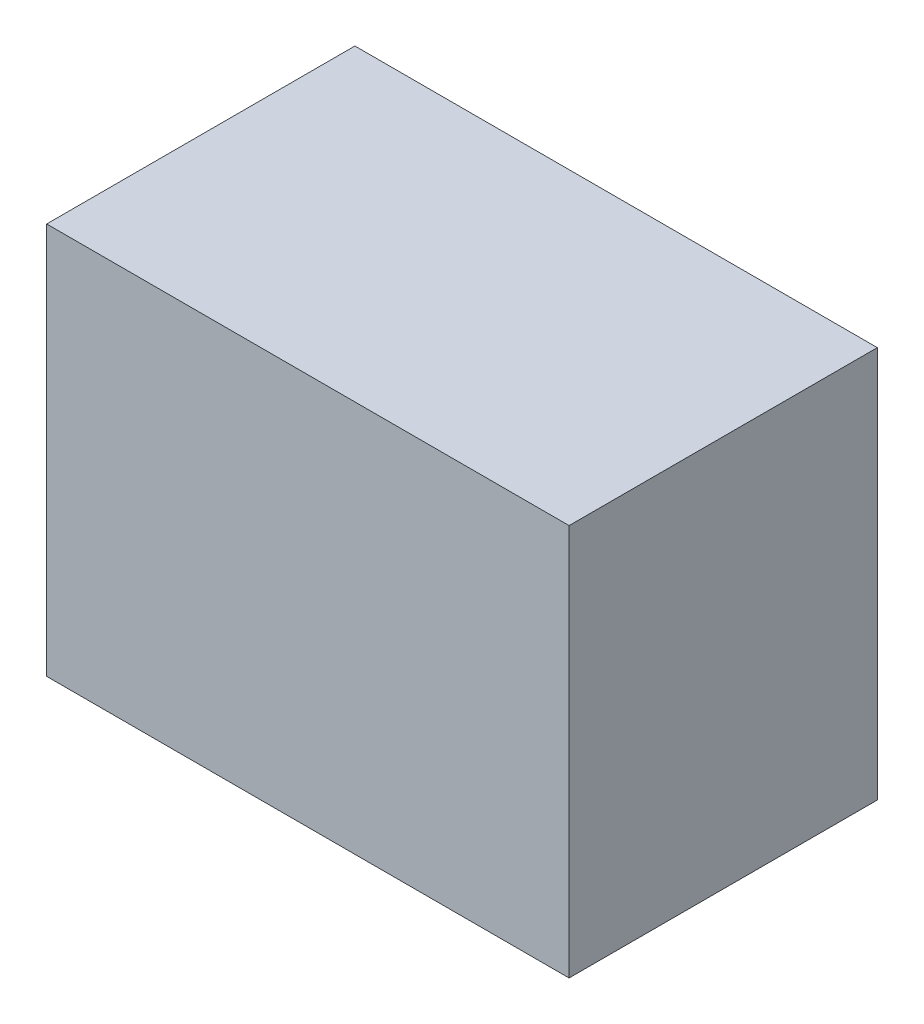
ISO-10303-21;
HEADER;
FILE_DESCRIPTION(('STEP AP214'),'2;1');
FILE_NAME('part.step','',(''),(''),'','','');
FILE_SCHEMA(('AUTOMOTIVE_DESIGN { 1 0 10303 214 1 1 1 1 }'));
ENDSEC;
DATA;
#1=APPLICATION_CONTEXT('core data for automotive mechanical design processes');
#2=APPLICATION_PROTOCOL_DEFINITION('international standard','automotive_design',2000,#1);
#3=PRODUCT_CONTEXT('',#1,'mechanical');
#4=PRODUCT('Part','Part','',(#3));
#5=PRODUCT_RELATED_PRODUCT_CATEGORY('part','',(#4));
#6=PRODUCT_DEFINITION_FORMATION('','',#4);
#7=PRODUCT_DEFINITION_CONTEXT('part definition',#1,'design');
#8=PRODUCT_DEFINITION('design','',#6,#7);
#9=PRODUCT_DEFINITION_SHAPE('','',#8);
#10=(LENGTH_UNIT() NAMED_UNIT(*) SI_UNIT(.MILLI.,.METRE.));
#11=(NAMED_UNIT(*) PLANE_ANGLE_UNIT() SI_UNIT($,.RADIAN.));
#12=(NAMED_UNIT(*) SI_UNIT($,.STERADIAN.) SOLID_ANGLE_UNIT());
#13=UNCERTAINTY_MEASURE_WITH_UNIT(LENGTH_MEASURE(1.E-05),#10,'distance_accuracy_value','');
#14=(GEOMETRIC_REPRESENTATION_CONTEXT(3) GLOBAL_UNCERTAINTY_ASSIGNED_CONTEXT((#13)) GLOBAL_UNIT_ASSIGNED_CONTEXT((#10,
#11,#12)) REPRESENTATION_CONTEXT('',''));
#15=CARTESIAN_POINT('',(0.,0.,0.));
#16=DIRECTION('',(0.,0.,1.));
#17=DIRECTION('',(1.,0.,0.));
#18=AXIS2_PLACEMENT_3D('',#15,#16,#17);
#19=CARTESIAN_POINT('',(1.00000308,0.74997564,1.18000018));
#20=DIRECTION('',(0.,0.,-1.));
#21=DIRECTION('',(0.,-1.,0.));
#22=AXIS2_PLACEMENT_3D('',#19,#20,#21);
#23=PLANE('',#22);
#24=DIRECTION('',(-0.999999999883872,1.5239972410078E-05,0.));
#25=VECTOR('',#24,1.);
#26=CARTESIAN_POINT('',(1.00000308,0.74997564,1.18000018));
#27=LINE('',#26,#25);
#28=CARTESIAN_POINT('',(1.00000308,0.74997564,1.18000018));
#29=VERTEX_POINT('',#28);
#30=CARTESIAN_POINT('',(-1.00000054,0.75000612,1.18000018));
#31=VERTEX_POINT('',#30);
#32=EDGE_CURVE('E89',#29,#31,#27,.T.);
#33=ORIENTED_EDGE('',*,*,#32,.T.);
#34=DIRECTION('',(-1.69331951384027E-06,-0.999999999998566,0.));
#35=VECTOR('',#34,1.);
#36=CARTESIAN_POINT('',(-1.00000054,0.75000612,1.18000018));
#37=LINE('',#36,#35);
#38=CARTESIAN_POINT('',(-1.00000308,-0.75000612,1.18000018));
#39=VERTEX_POINT('',#38);
#40=EDGE_CURVE('E20',#31,#39,#37,.T.);
#41=ORIENTED_EDGE('',*,*,#40,.T.);
#42=DIRECTION('',(1.,0.,0.));
#43=VECTOR('',#42,1.);
#44=CARTESIAN_POINT('',(-1.00000308,-0.75000612,1.18000018));
#45=LINE('',#44,#43);
#46=CARTESIAN_POINT('',(0.99997768,-0.75000612,1.18000018));
#47=VERTEX_POINT('',#46);
#48=EDGE_CURVE('E82',#39,#47,#45,.T.);
#49=ORIENTED_EDGE('',*,*,#48,.T.);
#50=DIRECTION('',(1.69335392416637E-05,0.999999999856628,0.));
#51=VECTOR('',#50,1.);
#52=CARTESIAN_POINT('',(0.99997768,-0.75000612,1.18000018));
#53=LINE('',#52,#51);
#54=EDGE_CURVE('E11',#47,#29,#53,.T.);
#55=ORIENTED_EDGE('',*,*,#54,.T.);
#56=EDGE_LOOP('',(#33,#41,#49,#55));
#57=FACE_BOUND('',#56,.T.);
#58=ADVANCED_FACE('F17',(#57),#23,.F.);
#59=CARTESIAN_POINT('',(1.00000308,0.74997564,0.));
#60=DIRECTION('',(0.,0.,-1.));
#61=DIRECTION('',(0.,-1.,0.));
#62=AXIS2_PLACEMENT_3D('',#59,#60,#61);
#63=PLANE('',#62);
#64=DIRECTION('',(-0.999999999883872,1.5239972410078E-05,0.));
#65=VECTOR('',#64,1.);
#66=CARTESIAN_POINT('',(1.00000308,0.74997564,0.));
#67=LINE('',#66,#65);
#68=CARTESIAN_POINT('',(1.00000308,0.74997564,0.));
#69=VERTEX_POINT('',#68);
#70=CARTESIAN_POINT('',(-1.00000054,0.75000612,0.));
#71=VERTEX_POINT('',#70);
#72=EDGE_CURVE('E109',#69,#71,#67,.T.);
#73=ORIENTED_EDGE('',*,*,#72,.F.);
#74=DIRECTION('',(1.69335392416637E-05,0.999999999856628,0.));
#75=VECTOR('',#74,1.);
#76=CARTESIAN_POINT('',(0.99997768,-0.75000612,0.));
#77=LINE('',#76,#75);
#78=CARTESIAN_POINT('',(0.99997768,-0.75000612,0.));
#79=VERTEX_POINT('',#78);
#80=EDGE_CURVE('E27',#79,#69,#77,.T.);
#81=ORIENTED_EDGE('',*,*,#80,.F.);
#82=DIRECTION('',(1.,0.,0.));
#83=VECTOR('',#82,1.);
#84=CARTESIAN_POINT('',(-1.00000308,-0.75000612,0.));
#85=LINE('',#84,#83);
#86=CARTESIAN_POINT('',(-1.00000308,-0.75000612,0.));
#87=VERTEX_POINT('',#86);
#88=EDGE_CURVE('E92',#87,#79,#85,.T.);
#89=ORIENTED_EDGE('',*,*,#88,.F.);
#90=DIRECTION('',(-1.69331951384027E-06,-0.999999999998566,0.));
#91=VECTOR('',#90,1.);
#92=CARTESIAN_POINT('',(-1.00000054,0.75000612,0.));
#93=LINE('',#92,#91);
#94=EDGE_CURVE('E65',#71,#87,#93,.T.);
#95=ORIENTED_EDGE('',*,*,#94,.F.);
#96=EDGE_LOOP('',(#73,#81,#89,#95));
#97=FACE_BOUND('',#96,.T.);
#98=ADVANCED_FACE('F124',(#97),#63,.T.);
#99=CARTESIAN_POINT('',(0.99997768,-0.75000612,0.));
#100=DIRECTION('',(-0.999999999856628,1.69335392416637E-05,0.));
#101=DIRECTION('',(0.,0.,1.));
#102=AXIS2_PLACEMENT_3D('',#99,#100,#101);
#103=PLANE('',#102);
#104=DIRECTION('',(0.,0.,1.));
#105=VECTOR('',#104,1.);
#106=CARTESIAN_POINT('',(0.99997768,-0.75000612,0.));
#107=LINE('',#106,#105);
#108=EDGE_CURVE('E86',#79,#47,#107,.T.);
#109=ORIENTED_EDGE('',*,*,#108,.F.);
#110=ORIENTED_EDGE('',*,*,#80,.T.);
#111=DIRECTION('',(0.,0.,1.));
#112=VECTOR('',#111,1.);
#113=CARTESIAN_POINT('',(1.00000308,0.74997564,0.));
#114=LINE('',#113,#112);
#115=EDGE_CURVE('E113',#69,#29,#114,.T.);
#116=ORIENTED_EDGE('',*,*,#115,.T.);
#117=ORIENTED_EDGE('',*,*,#54,.F.);
#118=EDGE_LOOP('',(#109,#110,#116,#117));
#119=FACE_BOUND('',#118,.T.);
#120=ADVANCED_FACE('F121',(#119),#103,.F.);
#121=CARTESIAN_POINT('',(-1.00000308,-0.75000612,0.));
#122=DIRECTION('',(0.,1.,0.));
#123=DIRECTION('',(1.,0.,0.));
#124=AXIS2_PLACEMENT_3D('',#121,#122,#123);
#125=PLANE('',#124);
#126=DIRECTION('',(0.,0.,1.));
#127=VECTOR('',#126,1.);
#128=CARTESIAN_POINT('',(-1.00000308,-0.75000612,0.));
#129=LINE('',#128,#127);
#130=EDGE_CURVE('E85',#87,#39,#129,.T.);
#131=ORIENTED_EDGE('',*,*,#130,.F.);
#132=ORIENTED_EDGE('',*,*,#88,.T.);
#133=ORIENTED_EDGE('',*,*,#108,.T.);
#134=ORIENTED_EDGE('',*,*,#48,.F.);
#135=EDGE_LOOP('',(#131,#132,#133,#134));
#136=FACE_BOUND('',#135,.T.);
#137=ADVANCED_FACE('F83',(#136),#125,.F.);
#138=CARTESIAN_POINT('',(-1.00000054,0.75000612,0.));
#139=DIRECTION('',(0.999999999998566,-1.69331951384027E-06,0.));
#140=DIRECTION('',(0.,0.,-1.));
#141=AXIS2_PLACEMENT_3D('',#138,#139,#140);
#142=PLANE('',#141);
#143=DIRECTION('',(0.,0.,1.));
#144=VECTOR('',#143,1.);
#145=CARTESIAN_POINT('',(-1.00000054,0.75000612,0.));
#146=LINE('',#145,#144);
#147=EDGE_CURVE('E106',#71,#31,#146,.T.);
#148=ORIENTED_EDGE('',*,*,#147,.F.);
#149=ORIENTED_EDGE('',*,*,#94,.T.);
#150=ORIENTED_EDGE('',*,*,#130,.T.);
#151=ORIENTED_EDGE('',*,*,#40,.F.);
#152=EDGE_LOOP('',(#148,#149,#150,#151));
#153=FACE_BOUND('',#152,.T.);
#154=ADVANCED_FACE('F93',(#153),#142,.F.);
#155=CARTESIAN_POINT('',(1.00000308,0.74997564,0.));
#156=DIRECTION('',(-1.5239972410078E-05,-0.999999999883872,0.));
#157=DIRECTION('',(-0.999999999883872,1.5239972410078E-05,0.));
#158=AXIS2_PLACEMENT_3D('',#155,#156,#157);
#159=PLANE('',#158);
#160=ORIENTED_EDGE('',*,*,#115,.F.);
#161=ORIENTED_EDGE('',*,*,#72,.T.);
#162=ORIENTED_EDGE('',*,*,#147,.T.);
#163=ORIENTED_EDGE('',*,*,#32,.F.);
#164=EDGE_LOOP('',(#160,#161,#162,#163));
#165=FACE_BOUND('',#164,.T.);
#166=ADVANCED_FACE('F123',(#165),#159,.F.);
#167=CLOSED_SHELL('',(#58,#98,#120,#137,#154,#166));
#168=MANIFOLD_SOLID_BREP('B1',#167);
#169=ADVANCED_BREP_SHAPE_REPRESENTATION('',(#18,#168),#14);
#170=SHAPE_DEFINITION_REPRESENTATION(#9,#169);
ENDSEC;
END-ISO-10303-21;
